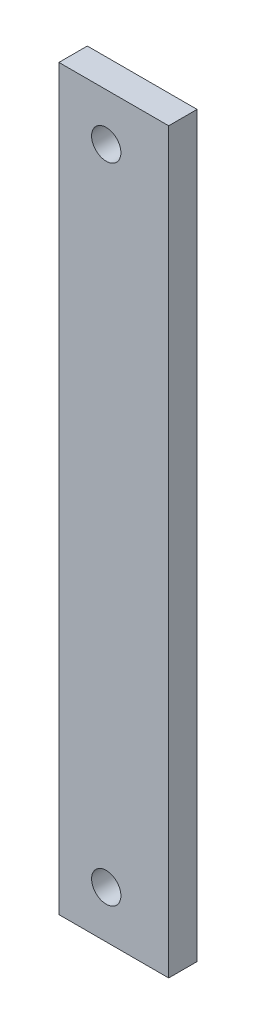
ISO-10303-21;
HEADER;
FILE_DESCRIPTION(('STEP AP214'),'2;1');
FILE_NAME('part.step','',(''),(''),'','','');
FILE_SCHEMA(('AUTOMOTIVE_DESIGN { 1 0 10303 214 1 1 1 1 }'));
ENDSEC;
DATA;
#1=APPLICATION_CONTEXT('core data for automotive mechanical design processes');
#2=APPLICATION_PROTOCOL_DEFINITION('international standard','automotive_design',2000,#1);
#3=PRODUCT_CONTEXT('',#1,'mechanical');
#4=PRODUCT('Part','Part','',(#3));
#5=PRODUCT_RELATED_PRODUCT_CATEGORY('part','',(#4));
#6=PRODUCT_DEFINITION_FORMATION('','',#4);
#7=PRODUCT_DEFINITION_CONTEXT('part definition',#1,'design');
#8=PRODUCT_DEFINITION('design','',#6,#7);
#9=PRODUCT_DEFINITION_SHAPE('','',#8);
#10=(LENGTH_UNIT() NAMED_UNIT(*) SI_UNIT(.MILLI.,.METRE.));
#11=(NAMED_UNIT(*) PLANE_ANGLE_UNIT() SI_UNIT($,.RADIAN.));
#12=(NAMED_UNIT(*) SI_UNIT($,.STERADIAN.) SOLID_ANGLE_UNIT());
#13=UNCERTAINTY_MEASURE_WITH_UNIT(LENGTH_MEASURE(1.E-05),#10,'distance_accuracy_value','');
#14=(GEOMETRIC_REPRESENTATION_CONTEXT(3) GLOBAL_UNCERTAINTY_ASSIGNED_CONTEXT((#13)) GLOBAL_UNIT_ASSIGNED_CONTEXT((#10,
#11,#12)) REPRESENTATION_CONTEXT('',''));
#15=CARTESIAN_POINT('',(0.,0.,0.));
#16=DIRECTION('',(0.,0.,1.));
#17=DIRECTION('',(1.,0.,0.));
#18=AXIS2_PLACEMENT_3D('',#15,#16,#17);
#19=CARTESIAN_POINT('',(0.,0.,0.));
#20=DIRECTION('',(0.,0.,-1.));
#21=DIRECTION('',(-1.,0.,0.));
#22=AXIS2_PLACEMENT_3D('',#19,#20,#21);
#23=PLANE('',#22);
#24=CARTESIAN_POINT('',(3006.10961814736,6417.31,0.));
#25=DIRECTION('',(0.,0.,1.));
#26=DIRECTION('',(1.,0.,0.));
#27=AXIS2_PLACEMENT_3D('',#24,#25,#26);
#28=CIRCLE('',#27,2.45745000000008);
#29=CARTESIAN_POINT('',(3008.56706814736,6417.31,0.));
#30=VERTEX_POINT('',#29);
#31=EDGE_CURVE('E134',#30,#30,#28,.T.);
#32=ORIENTED_EDGE('',*,*,#31,.T.);
#33=EDGE_LOOP('',(#32));
#34=FACE_BOUND('',#33,.T.);
#35=DIRECTION('',(0.,-1.,0.));
#36=VECTOR('',#35,1.);
#37=CARTESIAN_POINT('',(2998.17211814736,6301.4225,0.));
#38=LINE('',#37,#36);
#39=CARTESIAN_POINT('',(2998.17211814736,6425.2475,0.));
#40=VERTEX_POINT('',#39);
#41=CARTESIAN_POINT('',(2998.17211814736,6301.4225,0.));
#42=VERTEX_POINT('',#41);
#43=EDGE_CURVE('E109',#40,#42,#38,.T.);
#44=ORIENTED_EDGE('',*,*,#43,.F.);
#45=DIRECTION('',(-1.,0.,0.));
#46=VECTOR('',#45,1.);
#47=CARTESIAN_POINT('',(2998.17211814736,6425.2475,0.));
#48=LINE('',#47,#46);
#49=CARTESIAN_POINT('',(3016.58711814735,6425.2475,0.));
#50=VERTEX_POINT('',#49);
#51=EDGE_CURVE('E79',#50,#40,#48,.T.);
#52=ORIENTED_EDGE('',*,*,#51,.F.);
#53=DIRECTION('',(0.,1.,0.));
#54=VECTOR('',#53,1.);
#55=CARTESIAN_POINT('',(3016.58711814735,6301.4225,0.));
#56=LINE('',#55,#54);
#57=CARTESIAN_POINT('',(3016.58711814735,6301.4225,0.));
#58=VERTEX_POINT('',#57);
#59=EDGE_CURVE('E73',#58,#50,#56,.T.);
#60=ORIENTED_EDGE('',*,*,#59,.F.);
#61=DIRECTION('',(1.,0.,0.));
#62=VECTOR('',#61,1.);
#63=CARTESIAN_POINT('',(2998.17211814736,6301.4225,0.));
#64=LINE('',#63,#62);
#65=EDGE_CURVE('E96',#42,#58,#64,.T.);
#66=ORIENTED_EDGE('',*,*,#65,.F.);
#67=EDGE_LOOP('',(#44,#52,#60,#66));
#68=FACE_BOUND('',#67,.T.);
#69=CARTESIAN_POINT('',(3006.10961814736,6309.36,0.));
#70=DIRECTION('',(0.,0.,1.));
#71=DIRECTION('',(1.,0.,0.));
#72=AXIS2_PLACEMENT_3D('',#69,#70,#71);
#73=CIRCLE('',#72,2.45745000000008);
#74=CARTESIAN_POINT('',(3008.56706814736,6309.36,0.));
#75=VERTEX_POINT('',#74);
#76=EDGE_CURVE('E113',#75,#75,#73,.T.);
#77=ORIENTED_EDGE('',*,*,#76,.T.);
#78=EDGE_LOOP('',(#77));
#79=FACE_BOUND('',#78,.T.);
#80=ADVANCED_FACE('F36',(#34,#68,#79),#23,.T.);
#81=CARTESIAN_POINT('',(2998.17211814736,6301.4225,4.7625));
#82=DIRECTION('',(1.,0.,0.));
#83=DIRECTION('',(0.,0.,-1.));
#84=AXIS2_PLACEMENT_3D('',#81,#82,#83);
#85=PLANE('',#84);
#86=ORIENTED_EDGE('',*,*,#43,.T.);
#87=DIRECTION('',(0.,0.,-1.));
#88=VECTOR('',#87,1.);
#89=CARTESIAN_POINT('',(2998.17211814736,6301.4225,4.7625));
#90=LINE('',#89,#88);
#91=CARTESIAN_POINT('',(2998.17211814736,6301.4225,4.7625));
#92=VERTEX_POINT('',#91);
#93=EDGE_CURVE('E11',#92,#42,#90,.T.);
#94=ORIENTED_EDGE('',*,*,#93,.F.);
#95=DIRECTION('',(0.,-1.,0.));
#96=VECTOR('',#95,1.);
#97=CARTESIAN_POINT('',(2998.17211814736,6301.4225,4.7625));
#98=LINE('',#97,#96);
#99=CARTESIAN_POINT('',(2998.17211814736,6425.2475,4.7625));
#100=VERTEX_POINT('',#99);
#101=EDGE_CURVE('E92',#100,#92,#98,.T.);
#102=ORIENTED_EDGE('',*,*,#101,.F.);
#103=DIRECTION('',(0.,0.,-1.));
#104=VECTOR('',#103,1.);
#105=CARTESIAN_POINT('',(2998.17211814736,6425.2475,4.7625));
#106=LINE('',#105,#104);
#107=EDGE_CURVE('E105',#100,#40,#106,.T.);
#108=ORIENTED_EDGE('',*,*,#107,.T.);
#109=EDGE_LOOP('',(#86,#94,#102,#108));
#110=FACE_BOUND('',#109,.T.);
#111=ADVANCED_FACE('F38',(#110),#85,.F.);
#112=CARTESIAN_POINT('',(2998.17211814736,6301.4225,4.7625));
#113=DIRECTION('',(0.,1.,0.));
#114=DIRECTION('',(0.,0.,1.));
#115=AXIS2_PLACEMENT_3D('',#112,#113,#114);
#116=PLANE('',#115);
#117=ORIENTED_EDGE('',*,*,#65,.T.);
#118=DIRECTION('',(0.,0.,-1.));
#119=VECTOR('',#118,1.);
#120=CARTESIAN_POINT('',(3016.58711814735,6301.4225,4.7625));
#121=LINE('',#120,#119);
#122=CARTESIAN_POINT('',(3016.58711814735,6301.4225,4.7625));
#123=VERTEX_POINT('',#122);
#124=EDGE_CURVE('E45',#123,#58,#121,.T.);
#125=ORIENTED_EDGE('',*,*,#124,.F.);
#126=DIRECTION('',(1.,0.,0.));
#127=VECTOR('',#126,1.);
#128=CARTESIAN_POINT('',(2998.17211814736,6301.4225,4.7625));
#129=LINE('',#128,#127);
#130=EDGE_CURVE('E86',#92,#123,#129,.T.);
#131=ORIENTED_EDGE('',*,*,#130,.F.);
#132=ORIENTED_EDGE('',*,*,#93,.T.);
#133=EDGE_LOOP('',(#117,#125,#131,#132));
#134=FACE_BOUND('',#133,.T.);
#135=ADVANCED_FACE('F95',(#134),#116,.F.);
#136=CARTESIAN_POINT('',(3016.58711814735,6301.4225,4.7625));
#137=DIRECTION('',(-1.,0.,0.));
#138=DIRECTION('',(0.,0.,1.));
#139=AXIS2_PLACEMENT_3D('',#136,#137,#138);
#140=PLANE('',#139);
#141=ORIENTED_EDGE('',*,*,#59,.T.);
#142=DIRECTION('',(0.,0.,-1.));
#143=VECTOR('',#142,1.);
#144=CARTESIAN_POINT('',(3016.58711814735,6425.2475,4.7625));
#145=LINE('',#144,#143);
#146=CARTESIAN_POINT('',(3016.58711814735,6425.2475,4.7625));
#147=VERTEX_POINT('',#146);
#148=EDGE_CURVE('E98',#147,#50,#145,.T.);
#149=ORIENTED_EDGE('',*,*,#148,.F.);
#150=DIRECTION('',(0.,1.,0.));
#151=VECTOR('',#150,1.);
#152=CARTESIAN_POINT('',(3016.58711814735,6301.4225,4.7625));
#153=LINE('',#152,#151);
#154=EDGE_CURVE('E90',#123,#147,#153,.T.);
#155=ORIENTED_EDGE('',*,*,#154,.F.);
#156=ORIENTED_EDGE('',*,*,#124,.T.);
#157=EDGE_LOOP('',(#141,#149,#155,#156));
#158=FACE_BOUND('',#157,.T.);
#159=ADVANCED_FACE('F99',(#158),#140,.F.);
#160=CARTESIAN_POINT('',(2998.17211814736,6425.2475,4.7625));
#161=DIRECTION('',(0.,-1.,0.));
#162=DIRECTION('',(0.,0.,-1.));
#163=AXIS2_PLACEMENT_3D('',#160,#161,#162);
#164=PLANE('',#163);
#165=ORIENTED_EDGE('',*,*,#51,.T.);
#166=ORIENTED_EDGE('',*,*,#107,.F.);
#167=DIRECTION('',(-1.,0.,0.));
#168=VECTOR('',#167,1.);
#169=CARTESIAN_POINT('',(2998.17211814736,6425.2475,4.7625));
#170=LINE('',#169,#168);
#171=EDGE_CURVE('E53',#147,#100,#170,.T.);
#172=ORIENTED_EDGE('',*,*,#171,.F.);
#173=ORIENTED_EDGE('',*,*,#148,.T.);
#174=EDGE_LOOP('',(#165,#166,#172,#173));
#175=FACE_BOUND('',#174,.T.);
#176=ADVANCED_FACE('F121',(#175),#164,.F.);
#177=CARTESIAN_POINT('',(0.,0.,4.7625));
#178=DIRECTION('',(0.,0.,-1.));
#179=DIRECTION('',(-1.,0.,0.));
#180=AXIS2_PLACEMENT_3D('',#177,#178,#179);
#181=PLANE('',#180);
#182=CARTESIAN_POINT('',(3006.10961814736,6417.31,4.7625));
#183=DIRECTION('',(0.,0.,1.));
#184=DIRECTION('',(1.,0.,0.));
#185=AXIS2_PLACEMENT_3D('',#182,#183,#184);
#186=CIRCLE('',#185,2.45745000000008);
#187=CARTESIAN_POINT('',(3008.56706814736,6417.31,4.7625));
#188=VERTEX_POINT('',#187);
#189=EDGE_CURVE('E138',#188,#188,#186,.T.);
#190=ORIENTED_EDGE('',*,*,#189,.F.);
#191=EDGE_LOOP('',(#190));
#192=FACE_BOUND('',#191,.T.);
#193=CARTESIAN_POINT('',(3006.10961814736,6309.36,4.7625));
#194=DIRECTION('',(0.,0.,1.));
#195=DIRECTION('',(1.,0.,0.));
#196=AXIS2_PLACEMENT_3D('',#193,#194,#195);
#197=CIRCLE('',#196,2.45745000000008);
#198=CARTESIAN_POINT('',(3008.56706814736,6309.36,4.7625));
#199=VERTEX_POINT('',#198);
#200=EDGE_CURVE('E130',#199,#199,#197,.T.);
#201=ORIENTED_EDGE('',*,*,#200,.F.);
#202=EDGE_LOOP('',(#201));
#203=FACE_BOUND('',#202,.T.);
#204=ORIENTED_EDGE('',*,*,#101,.T.);
#205=ORIENTED_EDGE('',*,*,#130,.T.);
#206=ORIENTED_EDGE('',*,*,#154,.T.);
#207=ORIENTED_EDGE('',*,*,#171,.T.);
#208=EDGE_LOOP('',(#204,#205,#206,#207));
#209=FACE_BOUND('',#208,.T.);
#210=ADVANCED_FACE('F88',(#192,#203,#209),#181,.F.);
#211=CARTESIAN_POINT('',(3006.10961814736,6309.36,4.7625));
#212=DIRECTION('',(0.,0.,1.));
#213=DIRECTION('',(1.,0.,0.));
#214=AXIS2_PLACEMENT_3D('',#211,#212,#213);
#215=CYLINDRICAL_SURFACE('',#214,2.45745000000008);
#216=ORIENTED_EDGE('',*,*,#76,.F.);
#217=EDGE_LOOP('',(#216));
#218=FACE_BOUND('',#217,.T.);
#219=ORIENTED_EDGE('',*,*,#200,.T.);
#220=EDGE_LOOP('',(#219));
#221=FACE_BOUND('',#220,.T.);
#222=ADVANCED_FACE('F147',(#218,#221),#215,.F.);
#223=CARTESIAN_POINT('',(3006.10961814736,6417.31,4.7625));
#224=DIRECTION('',(0.,0.,1.));
#225=DIRECTION('',(1.,0.,0.));
#226=AXIS2_PLACEMENT_3D('',#223,#224,#225);
#227=CYLINDRICAL_SURFACE('',#226,2.45745000000008);
#228=ORIENTED_EDGE('',*,*,#31,.F.);
#229=EDGE_LOOP('',(#228));
#230=FACE_BOUND('',#229,.T.);
#231=ORIENTED_EDGE('',*,*,#189,.T.);
#232=EDGE_LOOP('',(#231));
#233=FACE_BOUND('',#232,.T.);
#234=ADVANCED_FACE('F143',(#230,#233),#227,.F.);
#235=CLOSED_SHELL('',(#80,#111,#135,#159,#176,#210,#222,#234));
#236=MANIFOLD_SOLID_BREP('B2',#235);
#237=ADVANCED_BREP_SHAPE_REPRESENTATION('',(#18,#236),#14);
#238=SHAPE_DEFINITION_REPRESENTATION(#9,#237);
ENDSEC;
END-ISO-10303-21;
